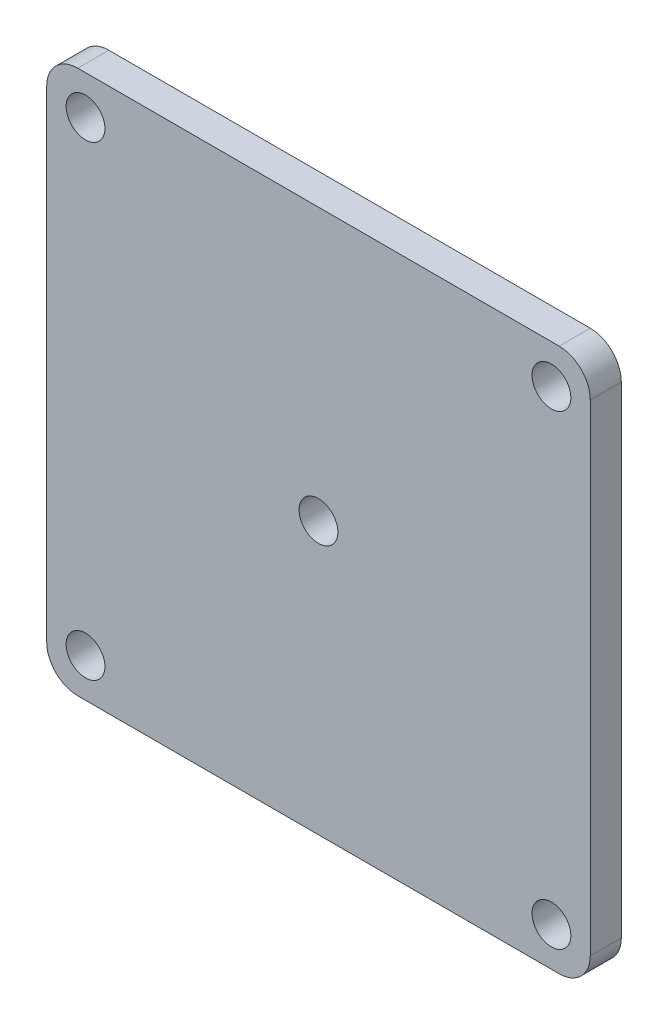
ISO-10303-21;
HEADER;
FILE_DESCRIPTION(('STEP AP214'),'2;1');
FILE_NAME('part.step','',(''),(''),'','','');
FILE_SCHEMA(('AUTOMOTIVE_DESIGN { 1 0 10303 214 1 1 1 1 }'));
ENDSEC;
DATA;
#1=APPLICATION_CONTEXT('core data for automotive mechanical design processes');
#2=APPLICATION_PROTOCOL_DEFINITION('international standard','automotive_design',2000,#1);
#3=PRODUCT_CONTEXT('',#1,'mechanical');
#4=PRODUCT('Part','Part','',(#3));
#5=PRODUCT_RELATED_PRODUCT_CATEGORY('part','',(#4));
#6=PRODUCT_DEFINITION_FORMATION('','',#4);
#7=PRODUCT_DEFINITION_CONTEXT('part definition',#1,'design');
#8=PRODUCT_DEFINITION('design','',#6,#7);
#9=PRODUCT_DEFINITION_SHAPE('','',#8);
#10=(LENGTH_UNIT() NAMED_UNIT(*) SI_UNIT(.MILLI.,.METRE.));
#11=(NAMED_UNIT(*) PLANE_ANGLE_UNIT() SI_UNIT($,.RADIAN.));
#12=(NAMED_UNIT(*) SI_UNIT($,.STERADIAN.) SOLID_ANGLE_UNIT());
#13=UNCERTAINTY_MEASURE_WITH_UNIT(LENGTH_MEASURE(1.E-05),#10,'distance_accuracy_value','');
#14=(GEOMETRIC_REPRESENTATION_CONTEXT(3) GLOBAL_UNCERTAINTY_ASSIGNED_CONTEXT((#13)) GLOBAL_UNIT_ASSIGNED_CONTEXT((#10,
#11,#12)) REPRESENTATION_CONTEXT('',''));
#15=CARTESIAN_POINT('',(0.,0.,0.));
#16=DIRECTION('',(0.,0.,1.));
#17=DIRECTION('',(1.,0.,0.));
#18=AXIS2_PLACEMENT_3D('',#15,#16,#17);
#19=CARTESIAN_POINT('',(0.,0.,2.54));
#20=DIRECTION('',(1.,0.,0.));
#21=DIRECTION('',(0.,0.,-1.));
#22=AXIS2_PLACEMENT_3D('',#19,#20,#21);
#23=PLANE('',#22);
#24=DIRECTION('',(0.,-1.,0.));
#25=VECTOR('',#24,1.);
#26=CARTESIAN_POINT('',(0.,0.,-2.54));
#27=LINE('',#26,#25);
#28=CARTESIAN_POINT('',(0.,83.82,-2.54));
#29=VERTEX_POINT('',#28);
#30=CARTESIAN_POINT('',(0.,5.08,-2.54));
#31=VERTEX_POINT('',#30);
#32=EDGE_CURVE('E130',#29,#31,#27,.T.);
#33=ORIENTED_EDGE('',*,*,#32,.T.);
#34=DIRECTION('',(0.,0.,-1.));
#35=VECTOR('',#34,1.);
#36=CARTESIAN_POINT('',(0.,5.08,2.54));
#37=LINE('',#36,#35);
#38=CARTESIAN_POINT('',(0.,5.08,2.54));
#39=VERTEX_POINT('',#38);
#40=EDGE_CURVE('E152',#31,#39,#37,.F.);
#41=ORIENTED_EDGE('',*,*,#40,.T.);
#42=DIRECTION('',(0.,-1.,0.));
#43=VECTOR('',#42,1.);
#44=CARTESIAN_POINT('',(0.,0.,2.54));
#45=LINE('',#44,#43);
#46=CARTESIAN_POINT('',(0.,83.82,2.54));
#47=VERTEX_POINT('',#46);
#48=EDGE_CURVE('E128',#47,#39,#45,.T.);
#49=ORIENTED_EDGE('',*,*,#48,.F.);
#50=DIRECTION('',(0.,0.,-1.));
#51=VECTOR('',#50,1.);
#52=CARTESIAN_POINT('',(0.,83.82,2.54));
#53=LINE('',#52,#51);
#54=EDGE_CURVE('E149',#47,#29,#53,.T.);
#55=ORIENTED_EDGE('',*,*,#54,.T.);
#56=EDGE_LOOP('',(#33,#41,#49,#55));
#57=FACE_BOUND('',#56,.T.);
#58=ADVANCED_FACE('F33',(#57),#23,.F.);
#59=CARTESIAN_POINT('',(0.,0.,2.54));
#60=DIRECTION('',(0.,1.,0.));
#61=DIRECTION('',(0.,0.,1.));
#62=AXIS2_PLACEMENT_3D('',#59,#60,#61);
#63=PLANE('',#62);
#64=DIRECTION('',(1.,0.,0.));
#65=VECTOR('',#64,1.);
#66=CARTESIAN_POINT('',(0.,0.,-2.54));
#67=LINE('',#66,#65);
#68=CARTESIAN_POINT('',(5.08,0.,-2.54));
#69=VERTEX_POINT('',#68);
#70=CARTESIAN_POINT('',(83.82,0.,-2.54));
#71=VERTEX_POINT('',#70);
#72=EDGE_CURVE('E126',#69,#71,#67,.T.);
#73=ORIENTED_EDGE('',*,*,#72,.T.);
#74=DIRECTION('',(0.,0.,-1.));
#75=VECTOR('',#74,1.);
#76=CARTESIAN_POINT('',(83.82,0.,2.54));
#77=LINE('',#76,#75);
#78=CARTESIAN_POINT('',(83.82,0.,2.54));
#79=VERTEX_POINT('',#78);
#80=EDGE_CURVE('E104',#71,#79,#77,.F.);
#81=ORIENTED_EDGE('',*,*,#80,.T.);
#82=DIRECTION('',(1.,0.,0.));
#83=VECTOR('',#82,1.);
#84=CARTESIAN_POINT('',(0.,0.,2.54));
#85=LINE('',#84,#83);
#86=CARTESIAN_POINT('',(5.08,0.,2.54));
#87=VERTEX_POINT('',#86);
#88=EDGE_CURVE('E166',#87,#79,#85,.T.);
#89=ORIENTED_EDGE('',*,*,#88,.F.);
#90=DIRECTION('',(0.,0.,-1.));
#91=VECTOR('',#90,1.);
#92=CARTESIAN_POINT('',(5.08,0.,2.54));
#93=LINE('',#92,#91);
#94=EDGE_CURVE('E109',#87,#69,#93,.T.);
#95=ORIENTED_EDGE('',*,*,#94,.T.);
#96=EDGE_LOOP('',(#73,#81,#89,#95));
#97=FACE_BOUND('',#96,.T.);
#98=ADVANCED_FACE('F171',(#97),#63,.F.);
#99=CARTESIAN_POINT('',(88.9,0.,2.54));
#100=DIRECTION('',(-1.,0.,0.));
#101=DIRECTION('',(0.,0.,1.));
#102=AXIS2_PLACEMENT_3D('',#99,#100,#101);
#103=PLANE('',#102);
#104=DIRECTION('',(0.,1.,0.));
#105=VECTOR('',#104,1.);
#106=CARTESIAN_POINT('',(88.9,0.,2.54));
#107=LINE('',#106,#105);
#108=CARTESIAN_POINT('',(88.9,5.08,2.54));
#109=VERTEX_POINT('',#108);
#110=CARTESIAN_POINT('',(88.9,83.82,2.54));
#111=VERTEX_POINT('',#110);
#112=EDGE_CURVE('E118',#109,#111,#107,.T.);
#113=ORIENTED_EDGE('',*,*,#112,.F.);
#114=DIRECTION('',(0.,0.,-1.));
#115=VECTOR('',#114,1.);
#116=CARTESIAN_POINT('',(88.9,5.08,2.54));
#117=LINE('',#116,#115);
#118=CARTESIAN_POINT('',(88.9,5.08,-2.54));
#119=VERTEX_POINT('',#118);
#120=EDGE_CURVE('E103',#109,#119,#117,.T.);
#121=ORIENTED_EDGE('',*,*,#120,.T.);
#122=DIRECTION('',(0.,1.,0.));
#123=VECTOR('',#122,1.);
#124=CARTESIAN_POINT('',(88.9,0.,-2.54));
#125=LINE('',#124,#123);
#126=CARTESIAN_POINT('',(88.9,83.82,-2.54));
#127=VERTEX_POINT('',#126);
#128=EDGE_CURVE('E116',#119,#127,#125,.T.);
#129=ORIENTED_EDGE('',*,*,#128,.T.);
#130=DIRECTION('',(0.,0.,-1.));
#131=VECTOR('',#130,1.);
#132=CARTESIAN_POINT('',(88.9,83.82,2.54));
#133=LINE('',#132,#131);
#134=EDGE_CURVE('E120',#127,#111,#133,.F.);
#135=ORIENTED_EDGE('',*,*,#134,.T.);
#136=EDGE_LOOP('',(#113,#121,#129,#135));
#137=FACE_BOUND('',#136,.T.);
#138=ADVANCED_FACE('F115',(#137),#103,.F.);
#139=CARTESIAN_POINT('',(0.,88.9,2.54));
#140=DIRECTION('',(0.,-1.,0.));
#141=DIRECTION('',(0.,0.,-1.));
#142=AXIS2_PLACEMENT_3D('',#139,#140,#141);
#143=PLANE('',#142);
#144=DIRECTION('',(-1.,0.,0.));
#145=VECTOR('',#144,1.);
#146=CARTESIAN_POINT('',(0.,88.9,2.54));
#147=LINE('',#146,#145);
#148=CARTESIAN_POINT('',(83.82,88.9,2.54));
#149=VERTEX_POINT('',#148);
#150=CARTESIAN_POINT('',(5.08,88.9,2.54));
#151=VERTEX_POINT('',#150);
#152=EDGE_CURVE('E134',#149,#151,#147,.T.);
#153=ORIENTED_EDGE('',*,*,#152,.F.);
#154=DIRECTION('',(0.,0.,-1.));
#155=VECTOR('',#154,1.);
#156=CARTESIAN_POINT('',(83.82,88.9,2.54));
#157=LINE('',#156,#155);
#158=CARTESIAN_POINT('',(83.82,88.9,-2.54));
#159=VERTEX_POINT('',#158);
#160=EDGE_CURVE('E11',#149,#159,#157,.T.);
#161=ORIENTED_EDGE('',*,*,#160,.T.);
#162=DIRECTION('',(-1.,0.,0.));
#163=VECTOR('',#162,1.);
#164=CARTESIAN_POINT('',(0.,88.9,-2.54));
#165=LINE('',#164,#163);
#166=CARTESIAN_POINT('',(5.08,88.9,-2.54));
#167=VERTEX_POINT('',#166);
#168=EDGE_CURVE('E125',#159,#167,#165,.T.);
#169=ORIENTED_EDGE('',*,*,#168,.T.);
#170=DIRECTION('',(0.,0.,-1.));
#171=VECTOR('',#170,1.);
#172=CARTESIAN_POINT('',(5.08,88.9,2.54));
#173=LINE('',#172,#171);
#174=EDGE_CURVE('E41',#167,#151,#173,.F.);
#175=ORIENTED_EDGE('',*,*,#174,.T.);
#176=EDGE_LOOP('',(#153,#161,#169,#175));
#177=FACE_BOUND('',#176,.T.);
#178=ADVANCED_FACE('F219',(#177),#143,.F.);
#179=CARTESIAN_POINT('',(0.,0.,2.54));
#180=DIRECTION('',(0.,0.,-1.));
#181=DIRECTION('',(-1.,0.,0.));
#182=AXIS2_PLACEMENT_3D('',#179,#180,#181);
#183=PLANE('',#182);
#184=CARTESIAN_POINT('',(6.34999999999999,82.55,2.54));
#185=DIRECTION('',(0.,0.,1.));
#186=DIRECTION('',(1.,0.,0.));
#187=AXIS2_PLACEMENT_3D('',#184,#185,#186);
#188=CIRCLE('',#187,3.175);
#189=CARTESIAN_POINT('',(9.52499999999999,82.55,2.54));
#190=VERTEX_POINT('',#189);
#191=EDGE_CURVE('E190',#190,#190,#188,.T.);
#192=ORIENTED_EDGE('',*,*,#191,.F.);
#193=EDGE_LOOP('',(#192));
#194=FACE_BOUND('',#193,.T.);
#195=CARTESIAN_POINT('',(82.55,6.35000000000002,2.54));
#196=DIRECTION('',(0.,0.,1.));
#197=DIRECTION('',(1.,0.,0.));
#198=AXIS2_PLACEMENT_3D('',#195,#196,#197);
#199=CIRCLE('',#198,3.175);
#200=CARTESIAN_POINT('',(85.725,6.35000000000002,2.54));
#201=VERTEX_POINT('',#200);
#202=EDGE_CURVE('E183',#201,#201,#199,.T.);
#203=ORIENTED_EDGE('',*,*,#202,.F.);
#204=EDGE_LOOP('',(#203));
#205=FACE_BOUND('',#204,.T.);
#206=CARTESIAN_POINT('',(6.34999999999999,6.35000000000001,2.54));
#207=DIRECTION('',(0.,0.,1.));
#208=DIRECTION('',(1.,0.,0.));
#209=AXIS2_PLACEMENT_3D('',#206,#207,#208);
#210=CIRCLE('',#209,3.175);
#211=CARTESIAN_POINT('',(9.52499999999999,6.35000000000001,2.54));
#212=VERTEX_POINT('',#211);
#213=EDGE_CURVE('E201',#212,#212,#210,.T.);
#214=ORIENTED_EDGE('',*,*,#213,.F.);
#215=EDGE_LOOP('',(#214));
#216=FACE_BOUND('',#215,.T.);
#217=CARTESIAN_POINT('',(44.45,44.45,2.54));
#218=DIRECTION('',(0.,0.,1.));
#219=DIRECTION('',(1.,0.,0.));
#220=AXIS2_PLACEMENT_3D('',#217,#218,#219);
#221=CIRCLE('',#220,3.175);
#222=CARTESIAN_POINT('',(47.625,44.45,2.54));
#223=VERTEX_POINT('',#222);
#224=EDGE_CURVE('E195',#223,#223,#221,.T.);
#225=ORIENTED_EDGE('',*,*,#224,.F.);
#226=EDGE_LOOP('',(#225));
#227=FACE_BOUND('',#226,.T.);
#228=CARTESIAN_POINT('',(82.55,82.55,2.54));
#229=DIRECTION('',(0.,0.,1.));
#230=DIRECTION('',(1.,0.,0.));
#231=AXIS2_PLACEMENT_3D('',#228,#229,#230);
#232=CIRCLE('',#231,3.175);
#233=CARTESIAN_POINT('',(85.725,82.55,2.54));
#234=VERTEX_POINT('',#233);
#235=EDGE_CURVE('E174',#234,#234,#232,.T.);
#236=ORIENTED_EDGE('',*,*,#235,.F.);
#237=EDGE_LOOP('',(#236));
#238=FACE_BOUND('',#237,.T.);
#239=ORIENTED_EDGE('',*,*,#88,.T.);
#240=CARTESIAN_POINT('',(83.82,5.08,2.54));
#241=DIRECTION('',(0.,0.,-1.));
#242=DIRECTION('',(-1.,0.,0.));
#243=AXIS2_PLACEMENT_3D('',#240,#241,#242);
#244=CIRCLE('',#243,5.08);
#245=EDGE_CURVE('E147',#79,#109,#244,.F.);
#246=ORIENTED_EDGE('',*,*,#245,.T.);
#247=ORIENTED_EDGE('',*,*,#112,.T.);
#248=CARTESIAN_POINT('',(83.82,83.82,2.54));
#249=DIRECTION('',(0.,0.,-1.));
#250=DIRECTION('',(-1.,0.,0.));
#251=AXIS2_PLACEMENT_3D('',#248,#249,#250);
#252=CIRCLE('',#251,5.08);
#253=EDGE_CURVE('E54',#111,#149,#252,.F.);
#254=ORIENTED_EDGE('',*,*,#253,.T.);
#255=ORIENTED_EDGE('',*,*,#152,.T.);
#256=CARTESIAN_POINT('',(5.08,83.82,2.54));
#257=DIRECTION('',(0.,0.,-1.));
#258=DIRECTION('',(-1.,0.,0.));
#259=AXIS2_PLACEMENT_3D('',#256,#257,#258);
#260=CIRCLE('',#259,5.08);
#261=EDGE_CURVE('E142',#151,#47,#260,.F.);
#262=ORIENTED_EDGE('',*,*,#261,.T.);
#263=ORIENTED_EDGE('',*,*,#48,.T.);
#264=CARTESIAN_POINT('',(5.08,5.08,2.54));
#265=DIRECTION('',(0.,0.,-1.));
#266=DIRECTION('',(-1.,0.,0.));
#267=AXIS2_PLACEMENT_3D('',#264,#265,#266);
#268=CIRCLE('',#267,5.08);
#269=EDGE_CURVE('E145',#39,#87,#268,.F.);
#270=ORIENTED_EDGE('',*,*,#269,.T.);
#271=EDGE_LOOP('',(#239,#246,#247,#254,#255,#262,#263,#270));
#272=FACE_BOUND('',#271,.T.);
#273=ADVANCED_FACE('F163',(#194,#205,#216,#227,#238,#272),#183,.F.);
#274=CARTESIAN_POINT('',(0.,0.,-2.54));
#275=DIRECTION('',(0.,0.,-1.));
#276=DIRECTION('',(-1.,0.,0.));
#277=AXIS2_PLACEMENT_3D('',#274,#275,#276);
#278=PLANE('',#277);
#279=CARTESIAN_POINT('',(6.34999999999999,82.55,-2.54));
#280=DIRECTION('',(0.,0.,1.));
#281=DIRECTION('',(1.,0.,0.));
#282=AXIS2_PLACEMENT_3D('',#279,#280,#281);
#283=CIRCLE('',#282,3.175);
#284=CARTESIAN_POINT('',(9.52499999999999,82.55,-2.54));
#285=VERTEX_POINT('',#284);
#286=EDGE_CURVE('E181',#285,#285,#283,.T.);
#287=ORIENTED_EDGE('',*,*,#286,.T.);
#288=EDGE_LOOP('',(#287));
#289=FACE_BOUND('',#288,.T.);
#290=CARTESIAN_POINT('',(82.55,6.35000000000002,-2.54));
#291=DIRECTION('',(0.,0.,1.));
#292=DIRECTION('',(1.,0.,0.));
#293=AXIS2_PLACEMENT_3D('',#290,#291,#292);
#294=CIRCLE('',#293,3.175);
#295=CARTESIAN_POINT('',(85.725,6.35000000000002,-2.54));
#296=VERTEX_POINT('',#295);
#297=EDGE_CURVE('E186',#296,#296,#294,.T.);
#298=ORIENTED_EDGE('',*,*,#297,.T.);
#299=EDGE_LOOP('',(#298));
#300=FACE_BOUND('',#299,.T.);
#301=CARTESIAN_POINT('',(6.34999999999999,6.35000000000001,-2.54));
#302=DIRECTION('',(0.,0.,1.));
#303=DIRECTION('',(1.,0.,0.));
#304=AXIS2_PLACEMENT_3D('',#301,#302,#303);
#305=CIRCLE('',#304,3.175);
#306=CARTESIAN_POINT('',(9.52499999999999,6.35000000000001,-2.54));
#307=VERTEX_POINT('',#306);
#308=EDGE_CURVE('E187',#307,#307,#305,.T.);
#309=ORIENTED_EDGE('',*,*,#308,.T.);
#310=EDGE_LOOP('',(#309));
#311=FACE_BOUND('',#310,.T.);
#312=CARTESIAN_POINT('',(44.45,44.45,-2.54));
#313=DIRECTION('',(0.,0.,1.));
#314=DIRECTION('',(1.,0.,0.));
#315=AXIS2_PLACEMENT_3D('',#312,#313,#314);
#316=CIRCLE('',#315,3.175);
#317=CARTESIAN_POINT('',(47.625,44.45,-2.54));
#318=VERTEX_POINT('',#317);
#319=EDGE_CURVE('E198',#318,#318,#316,.T.);
#320=ORIENTED_EDGE('',*,*,#319,.T.);
#321=EDGE_LOOP('',(#320));
#322=FACE_BOUND('',#321,.T.);
#323=CARTESIAN_POINT('',(82.55,82.55,-2.54));
#324=DIRECTION('',(0.,0.,1.));
#325=DIRECTION('',(1.,0.,0.));
#326=AXIS2_PLACEMENT_3D('',#323,#324,#325);
#327=CIRCLE('',#326,3.175);
#328=CARTESIAN_POINT('',(85.725,82.55,-2.54));
#329=VERTEX_POINT('',#328);
#330=EDGE_CURVE('E172',#329,#329,#327,.T.);
#331=ORIENTED_EDGE('',*,*,#330,.T.);
#332=EDGE_LOOP('',(#331));
#333=FACE_BOUND('',#332,.T.);
#334=ORIENTED_EDGE('',*,*,#128,.F.);
#335=CARTESIAN_POINT('',(83.82,5.08,-2.54));
#336=DIRECTION('',(0.,0.,-1.));
#337=DIRECTION('',(-1.,0.,0.));
#338=AXIS2_PLACEMENT_3D('',#335,#336,#337);
#339=CIRCLE('',#338,5.08);
#340=EDGE_CURVE('E99',#119,#71,#339,.T.);
#341=ORIENTED_EDGE('',*,*,#340,.T.);
#342=ORIENTED_EDGE('',*,*,#72,.F.);
#343=CARTESIAN_POINT('',(5.08,5.08,-2.54));
#344=DIRECTION('',(0.,0.,-1.));
#345=DIRECTION('',(-1.,0.,0.));
#346=AXIS2_PLACEMENT_3D('',#343,#344,#345);
#347=CIRCLE('',#346,5.08);
#348=EDGE_CURVE('E110',#69,#31,#347,.T.);
#349=ORIENTED_EDGE('',*,*,#348,.T.);
#350=ORIENTED_EDGE('',*,*,#32,.F.);
#351=CARTESIAN_POINT('',(5.08,83.82,-2.54));
#352=DIRECTION('',(0.,0.,-1.));
#353=DIRECTION('',(-1.,0.,0.));
#354=AXIS2_PLACEMENT_3D('',#351,#352,#353);
#355=CIRCLE('',#354,5.08);
#356=EDGE_CURVE('E119',#29,#167,#355,.T.);
#357=ORIENTED_EDGE('',*,*,#356,.T.);
#358=ORIENTED_EDGE('',*,*,#168,.F.);
#359=CARTESIAN_POINT('',(83.82,83.82,-2.54));
#360=DIRECTION('',(0.,0.,-1.));
#361=DIRECTION('',(-1.,0.,0.));
#362=AXIS2_PLACEMENT_3D('',#359,#360,#361);
#363=CIRCLE('',#362,5.08);
#364=EDGE_CURVE('E124',#159,#127,#363,.T.);
#365=ORIENTED_EDGE('',*,*,#364,.T.);
#366=EDGE_LOOP('',(#334,#341,#342,#349,#350,#357,#358,#365));
#367=FACE_BOUND('',#366,.T.);
#368=ADVANCED_FACE('F122',(#289,#300,#311,#322,#333,#367),#278,.T.);
#369=CARTESIAN_POINT('',(82.55,82.55,-2.54));
#370=DIRECTION('',(0.,0.,1.));
#371=DIRECTION('',(1.,0.,0.));
#372=AXIS2_PLACEMENT_3D('',#369,#370,#371);
#373=CYLINDRICAL_SURFACE('',#372,3.175);
#374=ORIENTED_EDGE('',*,*,#330,.F.);
#375=EDGE_LOOP('',(#374));
#376=FACE_BOUND('',#375,.T.);
#377=ORIENTED_EDGE('',*,*,#235,.T.);
#378=EDGE_LOOP('',(#377));
#379=FACE_BOUND('',#378,.T.);
#380=ADVANCED_FACE('F226',(#376,#379),#373,.F.);
#381=CARTESIAN_POINT('',(44.45,44.45,-2.54));
#382=DIRECTION('',(0.,0.,1.));
#383=DIRECTION('',(1.,0.,0.));
#384=AXIS2_PLACEMENT_3D('',#381,#382,#383);
#385=CYLINDRICAL_SURFACE('',#384,3.175);
#386=ORIENTED_EDGE('',*,*,#319,.F.);
#387=EDGE_LOOP('',(#386));
#388=FACE_BOUND('',#387,.T.);
#389=ORIENTED_EDGE('',*,*,#224,.T.);
#390=EDGE_LOOP('',(#389));
#391=FACE_BOUND('',#390,.T.);
#392=ADVANCED_FACE('F213',(#388,#391),#385,.F.);
#393=CARTESIAN_POINT('',(6.34999999999999,6.35000000000001,-2.54));
#394=DIRECTION('',(0.,0.,1.));
#395=DIRECTION('',(1.,0.,0.));
#396=AXIS2_PLACEMENT_3D('',#393,#394,#395);
#397=CYLINDRICAL_SURFACE('',#396,3.175);
#398=ORIENTED_EDGE('',*,*,#308,.F.);
#399=EDGE_LOOP('',(#398));
#400=FACE_BOUND('',#399,.T.);
#401=ORIENTED_EDGE('',*,*,#213,.T.);
#402=EDGE_LOOP('',(#401));
#403=FACE_BOUND('',#402,.T.);
#404=ADVANCED_FACE('F209',(#400,#403),#397,.F.);
#405=CARTESIAN_POINT('',(82.55,6.35000000000002,-2.54));
#406=DIRECTION('',(0.,0.,1.));
#407=DIRECTION('',(1.,0.,0.));
#408=AXIS2_PLACEMENT_3D('',#405,#406,#407);
#409=CYLINDRICAL_SURFACE('',#408,3.175);
#410=ORIENTED_EDGE('',*,*,#297,.F.);
#411=EDGE_LOOP('',(#410));
#412=FACE_BOUND('',#411,.T.);
#413=ORIENTED_EDGE('',*,*,#202,.T.);
#414=EDGE_LOOP('',(#413));
#415=FACE_BOUND('',#414,.T.);
#416=ADVANCED_FACE('F212',(#412,#415),#409,.F.);
#417=CARTESIAN_POINT('',(6.34999999999999,82.55,-2.54));
#418=DIRECTION('',(0.,0.,1.));
#419=DIRECTION('',(1.,0.,0.));
#420=AXIS2_PLACEMENT_3D('',#417,#418,#419);
#421=CYLINDRICAL_SURFACE('',#420,3.175);
#422=ORIENTED_EDGE('',*,*,#286,.F.);
#423=EDGE_LOOP('',(#422));
#424=FACE_BOUND('',#423,.T.);
#425=ORIENTED_EDGE('',*,*,#191,.T.);
#426=EDGE_LOOP('',(#425));
#427=FACE_BOUND('',#426,.T.);
#428=ADVANCED_FACE('F250',(#424,#427),#421,.F.);
#429=CARTESIAN_POINT('',(83.82,5.08,2.54));
#430=DIRECTION('',(0.,0.,-1.));
#431=DIRECTION('',(-1.,0.,0.));
#432=AXIS2_PLACEMENT_3D('',#429,#430,#431);
#433=CYLINDRICAL_SURFACE('',#432,5.08);
#434=ORIENTED_EDGE('',*,*,#245,.F.);
#435=ORIENTED_EDGE('',*,*,#80,.F.);
#436=ORIENTED_EDGE('',*,*,#340,.F.);
#437=ORIENTED_EDGE('',*,*,#120,.F.);
#438=EDGE_LOOP('',(#434,#435,#436,#437));
#439=FACE_BOUND('',#438,.T.);
#440=ADVANCED_FACE('F102',(#439),#433,.T.);
#441=CARTESIAN_POINT('',(5.08,5.08,2.54));
#442=DIRECTION('',(0.,0.,-1.));
#443=DIRECTION('',(-1.,0.,0.));
#444=AXIS2_PLACEMENT_3D('',#441,#442,#443);
#445=CYLINDRICAL_SURFACE('',#444,5.08);
#446=ORIENTED_EDGE('',*,*,#269,.F.);
#447=ORIENTED_EDGE('',*,*,#40,.F.);
#448=ORIENTED_EDGE('',*,*,#348,.F.);
#449=ORIENTED_EDGE('',*,*,#94,.F.);
#450=EDGE_LOOP('',(#446,#447,#448,#449));
#451=FACE_BOUND('',#450,.T.);
#452=ADVANCED_FACE('F169',(#451),#445,.T.);
#453=CARTESIAN_POINT('',(83.82,83.82,2.54));
#454=DIRECTION('',(0.,0.,-1.));
#455=DIRECTION('',(-1.,0.,0.));
#456=AXIS2_PLACEMENT_3D('',#453,#454,#455);
#457=CYLINDRICAL_SURFACE('',#456,5.08);
#458=ORIENTED_EDGE('',*,*,#253,.F.);
#459=ORIENTED_EDGE('',*,*,#134,.F.);
#460=ORIENTED_EDGE('',*,*,#364,.F.);
#461=ORIENTED_EDGE('',*,*,#160,.F.);
#462=EDGE_LOOP('',(#458,#459,#460,#461));
#463=FACE_BOUND('',#462,.T.);
#464=ADVANCED_FACE('F252',(#463),#457,.T.);
#465=CARTESIAN_POINT('',(5.08,83.82,2.54));
#466=DIRECTION('',(0.,0.,-1.));
#467=DIRECTION('',(-1.,0.,0.));
#468=AXIS2_PLACEMENT_3D('',#465,#466,#467);
#469=CYLINDRICAL_SURFACE('',#468,5.08);
#470=ORIENTED_EDGE('',*,*,#261,.F.);
#471=ORIENTED_EDGE('',*,*,#174,.F.);
#472=ORIENTED_EDGE('',*,*,#356,.F.);
#473=ORIENTED_EDGE('',*,*,#54,.F.);
#474=EDGE_LOOP('',(#470,#471,#472,#473));
#475=FACE_BOUND('',#474,.T.);
#476=ADVANCED_FACE('F35',(#475),#469,.T.);
#477=CLOSED_SHELL('',(#58,#98,#138,#178,#273,#368,#380,#392,#404,#416,#428,#440,#452,#464,#476));
#478=MANIFOLD_SOLID_BREP('B2',#477);
#479=ADVANCED_BREP_SHAPE_REPRESENTATION('',(#18,#478),#14);
#480=SHAPE_DEFINITION_REPRESENTATION(#9,#479);
ENDSEC;
END-ISO-10303-21;
